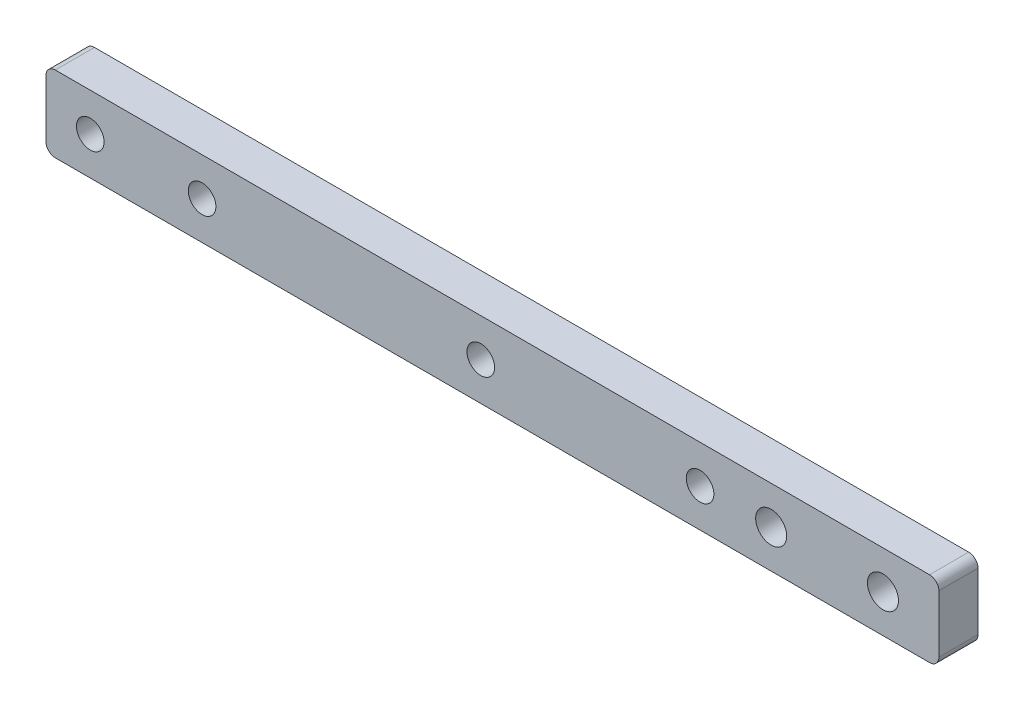
ISO-10303-21;
HEADER;
FILE_DESCRIPTION(('STEP AP214'),'2;1');
FILE_NAME('part.step','',(''),(''),'','','');
FILE_SCHEMA(('AUTOMOTIVE_DESIGN { 1 0 10303 214 1 1 1 1 }'));
ENDSEC;
DATA;
#1=APPLICATION_CONTEXT('core data for automotive mechanical design processes');
#2=APPLICATION_PROTOCOL_DEFINITION('international standard','automotive_design',2000,#1);
#3=PRODUCT_CONTEXT('',#1,'mechanical');
#4=PRODUCT('Part','Part','',(#3));
#5=PRODUCT_RELATED_PRODUCT_CATEGORY('part','',(#4));
#6=PRODUCT_DEFINITION_FORMATION('','',#4);
#7=PRODUCT_DEFINITION_CONTEXT('part definition',#1,'design');
#8=PRODUCT_DEFINITION('design','',#6,#7);
#9=PRODUCT_DEFINITION_SHAPE('','',#8);
#10=(LENGTH_UNIT() NAMED_UNIT(*) SI_UNIT(.MILLI.,.METRE.));
#11=(NAMED_UNIT(*) PLANE_ANGLE_UNIT() SI_UNIT($,.RADIAN.));
#12=(NAMED_UNIT(*) SI_UNIT($,.STERADIAN.) SOLID_ANGLE_UNIT());
#13=UNCERTAINTY_MEASURE_WITH_UNIT(LENGTH_MEASURE(1.E-05),#10,'distance_accuracy_value','');
#14=(GEOMETRIC_REPRESENTATION_CONTEXT(3) GLOBAL_UNCERTAINTY_ASSIGNED_CONTEXT((#13)) GLOBAL_UNIT_ASSIGNED_CONTEXT((#10,
#11,#12)) REPRESENTATION_CONTEXT('',''));
#15=CARTESIAN_POINT('',(0.,0.,0.));
#16=DIRECTION('',(0.,0.,1.));
#17=DIRECTION('',(1.,0.,0.));
#18=AXIS2_PLACEMENT_3D('',#15,#16,#17);
#19=CARTESIAN_POINT('',(0.,0.,3.2004));
#20=DIRECTION('',(0.,0.,1.));
#21=DIRECTION('',(1.,0.,0.));
#22=AXIS2_PLACEMENT_3D('',#19,#20,#21);
#23=PLANE('',#22);
#24=CARTESIAN_POINT('',(35.56,3.11150000000001,3.2004));
#25=DIRECTION('',(0.,0.,1.));
#26=DIRECTION('',(1.,0.,0.));
#27=AXIS2_PLACEMENT_3D('',#24,#25,#26);
#28=CIRCLE('',#27,1.1303);
#29=CARTESIAN_POINT('',(36.6903,3.11150000000001,3.2004));
#30=VERTEX_POINT('',#29);
#31=EDGE_CURVE('E204',#30,#30,#28,.T.);
#32=ORIENTED_EDGE('',*,*,#31,.F.);
#33=EDGE_LOOP('',(#32));
#34=FACE_BOUND('',#33,.T.);
#35=CARTESIAN_POINT('',(53.4924,3.11150000000002,3.2004));
#36=DIRECTION('',(0.,0.,1.));
#37=DIRECTION('',(1.,0.,0.));
#38=AXIS2_PLACEMENT_3D('',#35,#36,#37);
#39=CIRCLE('',#38,1.1303);
#40=CARTESIAN_POINT('',(54.6227,3.11150000000002,3.2004));
#41=VERTEX_POINT('',#40);
#42=EDGE_CURVE('E205',#41,#41,#39,.T.);
#43=ORIENTED_EDGE('',*,*,#42,.F.);
#44=EDGE_LOOP('',(#43));
#45=FACE_BOUND('',#44,.T.);
#46=CARTESIAN_POINT('',(3.6195,3.1115,3.2004));
#47=DIRECTION('',(0.,0.,1.));
#48=DIRECTION('',(1.,0.,0.));
#49=AXIS2_PLACEMENT_3D('',#46,#47,#48);
#50=CIRCLE('',#49,1.1303);
#51=CARTESIAN_POINT('',(4.7498,3.1115,3.2004));
#52=VERTEX_POINT('',#51);
#53=EDGE_CURVE('E186',#52,#52,#50,.T.);
#54=ORIENTED_EDGE('',*,*,#53,.F.);
#55=EDGE_LOOP('',(#54));
#56=FACE_BOUND('',#55,.T.);
#57=CARTESIAN_POINT('',(59.309,3.11150000000001,3.2004));
#58=DIRECTION('',(0.,0.,1.));
#59=DIRECTION('',(1.,0.,0.));
#60=AXIS2_PLACEMENT_3D('',#57,#58,#59);
#61=CIRCLE('',#60,1.27);
#62=CARTESIAN_POINT('',(60.579,3.11150000000001,3.2004));
#63=VERTEX_POINT('',#62);
#64=EDGE_CURVE('E132',#63,#63,#61,.T.);
#65=ORIENTED_EDGE('',*,*,#64,.F.);
#66=EDGE_LOOP('',(#65));
#67=FACE_BOUND('',#66,.T.);
#68=DIRECTION('',(0.,-1.,0.));
#69=VECTOR('',#68,1.);
#70=CARTESIAN_POINT('',(0.,6.223,3.2004));
#71=LINE('',#70,#69);
#72=CARTESIAN_POINT('',(0.,5.461,3.2004));
#73=VERTEX_POINT('',#72);
#74=CARTESIAN_POINT('',(0.,0.762,3.2004));
#75=VERTEX_POINT('',#74);
#76=EDGE_CURVE('E137',#73,#75,#71,.T.);
#77=ORIENTED_EDGE('',*,*,#76,.T.);
#78=CARTESIAN_POINT('',(0.762,0.762,3.2004));
#79=DIRECTION('',(0.,0.,1.));
#80=DIRECTION('',(1.,0.,0.));
#81=AXIS2_PLACEMENT_3D('',#78,#79,#80);
#82=CIRCLE('',#81,0.762);
#83=CARTESIAN_POINT('',(0.762,0.,3.2004));
#84=VERTEX_POINT('',#83);
#85=EDGE_CURVE('E152',#75,#84,#82,.T.);
#86=ORIENTED_EDGE('',*,*,#85,.T.);
#87=DIRECTION('',(1.,0.,0.));
#88=VECTOR('',#87,1.);
#89=CARTESIAN_POINT('',(0.,0.,3.2004));
#90=LINE('',#89,#88);
#91=CARTESIAN_POINT('',(72.263,0.,3.2004));
#92=VERTEX_POINT('',#91);
#93=EDGE_CURVE('E119',#84,#92,#90,.T.);
#94=ORIENTED_EDGE('',*,*,#93,.T.);
#95=CARTESIAN_POINT('',(72.263,0.762,3.2004));
#96=DIRECTION('',(0.,0.,1.));
#97=DIRECTION('',(1.,0.,0.));
#98=AXIS2_PLACEMENT_3D('',#95,#96,#97);
#99=CIRCLE('',#98,0.762);
#100=CARTESIAN_POINT('',(73.025,0.762,3.2004));
#101=VERTEX_POINT('',#100);
#102=EDGE_CURVE('E150',#92,#101,#99,.T.);
#103=ORIENTED_EDGE('',*,*,#102,.T.);
#104=DIRECTION('',(0.,1.,0.));
#105=VECTOR('',#104,1.);
#106=CARTESIAN_POINT('',(73.025,6.22300000000003,3.2004));
#107=LINE('',#106,#105);
#108=CARTESIAN_POINT('',(73.025,5.46100000000003,3.2004));
#109=VERTEX_POINT('',#108);
#110=EDGE_CURVE('E163',#101,#109,#107,.T.);
#111=ORIENTED_EDGE('',*,*,#110,.T.);
#112=CARTESIAN_POINT('',(72.263,5.46100000000003,3.2004));
#113=DIRECTION('',(0.,0.,1.));
#114=DIRECTION('',(1.,0.,0.));
#115=AXIS2_PLACEMENT_3D('',#112,#113,#114);
#116=CIRCLE('',#115,0.762);
#117=CARTESIAN_POINT('',(72.263,6.22300000000003,3.2004));
#118=VERTEX_POINT('',#117);
#119=EDGE_CURVE('E54',#109,#118,#116,.T.);
#120=ORIENTED_EDGE('',*,*,#119,.T.);
#121=DIRECTION('',(-1.,0.,0.));
#122=VECTOR('',#121,1.);
#123=CARTESIAN_POINT('',(0.,6.223,3.2004));
#124=LINE('',#123,#122);
#125=CARTESIAN_POINT('',(0.761999999999998,6.223,3.2004));
#126=VERTEX_POINT('',#125);
#127=EDGE_CURVE('E138',#118,#126,#124,.T.);
#128=ORIENTED_EDGE('',*,*,#127,.T.);
#129=CARTESIAN_POINT('',(0.761999999999999,5.461,3.2004));
#130=DIRECTION('',(0.,0.,1.));
#131=DIRECTION('',(1.,0.,0.));
#132=AXIS2_PLACEMENT_3D('',#129,#130,#131);
#133=CIRCLE('',#132,0.762);
#134=EDGE_CURVE('E147',#126,#73,#133,.T.);
#135=ORIENTED_EDGE('',*,*,#134,.T.);
#136=EDGE_LOOP('',(#77,#86,#94,#103,#111,#120,#128,#135));
#137=FACE_BOUND('',#136,.T.);
#138=CARTESIAN_POINT('',(68.453,3.11150000000002,3.2004));
#139=DIRECTION('',(0.,0.,1.));
#140=DIRECTION('',(1.,0.,0.));
#141=AXIS2_PLACEMENT_3D('',#138,#139,#140);
#142=CIRCLE('',#141,1.26999999999999);
#143=CARTESIAN_POINT('',(69.723,3.11150000000002,3.2004));
#144=VERTEX_POINT('',#143);
#145=EDGE_CURVE('E180',#144,#144,#142,.T.);
#146=ORIENTED_EDGE('',*,*,#145,.F.);
#147=EDGE_LOOP('',(#146));
#148=FACE_BOUND('',#147,.T.);
#149=CARTESIAN_POINT('',(12.7635,3.1115,3.2004));
#150=DIRECTION('',(0.,0.,1.));
#151=DIRECTION('',(1.,0.,0.));
#152=AXIS2_PLACEMENT_3D('',#149,#150,#151);
#153=CIRCLE('',#152,1.1303);
#154=CARTESIAN_POINT('',(13.8938,3.1115,3.2004));
#155=VERTEX_POINT('',#154);
#156=EDGE_CURVE('E192',#155,#155,#153,.T.);
#157=ORIENTED_EDGE('',*,*,#156,.F.);
#158=EDGE_LOOP('',(#157));
#159=FACE_BOUND('',#158,.T.);
#160=ADVANCED_FACE('F33',(#34,#45,#56,#67,#137,#148,#159),#23,.T.);
#161=CARTESIAN_POINT('',(0.,0.,0.));
#162=DIRECTION('',(0.,0.,1.));
#163=DIRECTION('',(1.,0.,0.));
#164=AXIS2_PLACEMENT_3D('',#161,#162,#163);
#165=PLANE('',#164);
#166=CARTESIAN_POINT('',(35.56,3.11150000000001,0.));
#167=DIRECTION('',(0.,0.,1.));
#168=DIRECTION('',(1.,0.,0.));
#169=AXIS2_PLACEMENT_3D('',#166,#167,#168);
#170=CIRCLE('',#169,1.1303);
#171=CARTESIAN_POINT('',(36.6903,3.11150000000001,0.));
#172=VERTEX_POINT('',#171);
#173=EDGE_CURVE('E198',#172,#172,#170,.F.);
#174=ORIENTED_EDGE('',*,*,#173,.F.);
#175=EDGE_LOOP('',(#174));
#176=FACE_BOUND('',#175,.T.);
#177=CARTESIAN_POINT('',(53.4924,3.11150000000002,0.));
#178=DIRECTION('',(0.,0.,1.));
#179=DIRECTION('',(1.,0.,0.));
#180=AXIS2_PLACEMENT_3D('',#177,#178,#179);
#181=CIRCLE('',#180,1.1303);
#182=CARTESIAN_POINT('',(54.6227,3.11150000000002,0.));
#183=VERTEX_POINT('',#182);
#184=EDGE_CURVE('E201',#183,#183,#181,.F.);
#185=ORIENTED_EDGE('',*,*,#184,.F.);
#186=EDGE_LOOP('',(#185));
#187=FACE_BOUND('',#186,.T.);
#188=DIRECTION('',(1.,0.,0.));
#189=VECTOR('',#188,1.);
#190=CARTESIAN_POINT('',(0.,0.,0.));
#191=LINE('',#190,#189);
#192=CARTESIAN_POINT('',(0.762,0.,0.));
#193=VERTEX_POINT('',#192);
#194=CARTESIAN_POINT('',(72.263,0.,0.));
#195=VERTEX_POINT('',#194);
#196=EDGE_CURVE('E116',#193,#195,#191,.T.);
#197=ORIENTED_EDGE('',*,*,#196,.F.);
#198=CARTESIAN_POINT('',(0.762,0.762,0.));
#199=DIRECTION('',(0.,0.,1.));
#200=DIRECTION('',(1.,0.,0.));
#201=AXIS2_PLACEMENT_3D('',#198,#199,#200);
#202=CIRCLE('',#201,0.762);
#203=CARTESIAN_POINT('',(0.,0.762,0.));
#204=VERTEX_POINT('',#203);
#205=EDGE_CURVE('E99',#193,#204,#202,.F.);
#206=ORIENTED_EDGE('',*,*,#205,.T.);
#207=DIRECTION('',(0.,-1.,0.));
#208=VECTOR('',#207,1.);
#209=CARTESIAN_POINT('',(0.,6.223,0.));
#210=LINE('',#209,#208);
#211=CARTESIAN_POINT('',(0.,5.461,0.));
#212=VERTEX_POINT('',#211);
#213=EDGE_CURVE('E127',#212,#204,#210,.T.);
#214=ORIENTED_EDGE('',*,*,#213,.F.);
#215=CARTESIAN_POINT('',(0.761999999999999,5.461,0.));
#216=DIRECTION('',(0.,0.,1.));
#217=DIRECTION('',(1.,0.,0.));
#218=AXIS2_PLACEMENT_3D('',#215,#216,#217);
#219=CIRCLE('',#218,0.762);
#220=CARTESIAN_POINT('',(0.761999999999998,6.223,0.));
#221=VERTEX_POINT('',#220);
#222=EDGE_CURVE('E120',#212,#221,#219,.F.);
#223=ORIENTED_EDGE('',*,*,#222,.T.);
#224=DIRECTION('',(-1.,0.,0.));
#225=VECTOR('',#224,1.);
#226=CARTESIAN_POINT('',(0.,6.223,0.));
#227=LINE('',#226,#225);
#228=CARTESIAN_POINT('',(72.263,6.22300000000003,0.));
#229=VERTEX_POINT('',#228);
#230=EDGE_CURVE('E130',#229,#221,#227,.T.);
#231=ORIENTED_EDGE('',*,*,#230,.F.);
#232=CARTESIAN_POINT('',(72.263,5.46100000000003,0.));
#233=DIRECTION('',(0.,0.,1.));
#234=DIRECTION('',(1.,0.,0.));
#235=AXIS2_PLACEMENT_3D('',#232,#233,#234);
#236=CIRCLE('',#235,0.762);
#237=CARTESIAN_POINT('',(73.025,5.46100000000003,0.));
#238=VERTEX_POINT('',#237);
#239=EDGE_CURVE('E141',#229,#238,#236,.F.);
#240=ORIENTED_EDGE('',*,*,#239,.T.);
#241=DIRECTION('',(0.,1.,0.));
#242=VECTOR('',#241,1.);
#243=CARTESIAN_POINT('',(73.025,6.22300000000003,0.));
#244=LINE('',#243,#242);
#245=CARTESIAN_POINT('',(73.025,0.762,0.));
#246=VERTEX_POINT('',#245);
#247=EDGE_CURVE('E126',#246,#238,#244,.T.);
#248=ORIENTED_EDGE('',*,*,#247,.F.);
#249=CARTESIAN_POINT('',(72.263,0.762,0.));
#250=DIRECTION('',(0.,0.,1.));
#251=DIRECTION('',(1.,0.,0.));
#252=AXIS2_PLACEMENT_3D('',#249,#250,#251);
#253=CIRCLE('',#252,0.762);
#254=EDGE_CURVE('E110',#246,#195,#253,.F.);
#255=ORIENTED_EDGE('',*,*,#254,.T.);
#256=EDGE_LOOP('',(#197,#206,#214,#223,#231,#240,#248,#255));
#257=FACE_BOUND('',#256,.T.);
#258=CARTESIAN_POINT('',(59.309,3.11150000000001,0.));
#259=DIRECTION('',(0.,0.,1.));
#260=DIRECTION('',(1.,0.,0.));
#261=AXIS2_PLACEMENT_3D('',#258,#259,#260);
#262=CIRCLE('',#261,1.27);
#263=CARTESIAN_POINT('',(60.579,3.11150000000001,0.));
#264=VERTEX_POINT('',#263);
#265=EDGE_CURVE('E177',#264,#264,#262,.T.);
#266=ORIENTED_EDGE('',*,*,#265,.T.);
#267=EDGE_LOOP('',(#266));
#268=FACE_BOUND('',#267,.T.);
#269=CARTESIAN_POINT('',(68.453,3.11150000000002,0.));
#270=DIRECTION('',(0.,0.,1.));
#271=DIRECTION('',(1.,0.,0.));
#272=AXIS2_PLACEMENT_3D('',#269,#270,#271);
#273=CIRCLE('',#272,1.26999999999999);
#274=CARTESIAN_POINT('',(69.723,3.11150000000002,0.));
#275=VERTEX_POINT('',#274);
#276=EDGE_CURVE('E183',#275,#275,#273,.T.);
#277=ORIENTED_EDGE('',*,*,#276,.T.);
#278=EDGE_LOOP('',(#277));
#279=FACE_BOUND('',#278,.T.);
#280=CARTESIAN_POINT('',(3.6195,3.1115,0.));
#281=DIRECTION('',(0.,0.,1.));
#282=DIRECTION('',(1.,0.,0.));
#283=AXIS2_PLACEMENT_3D('',#280,#281,#282);
#284=CIRCLE('',#283,1.1303);
#285=CARTESIAN_POINT('',(4.7498,3.1115,0.));
#286=VERTEX_POINT('',#285);
#287=EDGE_CURVE('E189',#286,#286,#284,.T.);
#288=ORIENTED_EDGE('',*,*,#287,.T.);
#289=EDGE_LOOP('',(#288));
#290=FACE_BOUND('',#289,.T.);
#291=CARTESIAN_POINT('',(12.7635,3.1115,0.));
#292=DIRECTION('',(0.,0.,1.));
#293=DIRECTION('',(1.,0.,0.));
#294=AXIS2_PLACEMENT_3D('',#291,#292,#293);
#295=CIRCLE('',#294,1.1303);
#296=CARTESIAN_POINT('',(13.8938,3.1115,0.));
#297=VERTEX_POINT('',#296);
#298=EDGE_CURVE('E195',#297,#297,#295,.T.);
#299=ORIENTED_EDGE('',*,*,#298,.T.);
#300=EDGE_LOOP('',(#299));
#301=FACE_BOUND('',#300,.T.);
#302=ADVANCED_FACE('F123',(#176,#187,#257,#268,#279,#290,#301),#165,.F.);
#303=CARTESIAN_POINT('',(0.,6.223,3.2004));
#304=DIRECTION('',(1.,0.,0.));
#305=DIRECTION('',(0.,1.,0.));
#306=AXIS2_PLACEMENT_3D('',#303,#304,#305);
#307=PLANE('',#306);
#308=ORIENTED_EDGE('',*,*,#213,.T.);
#309=DIRECTION('',(0.,0.,-1.));
#310=VECTOR('',#309,1.);
#311=CARTESIAN_POINT('',(0.,0.762,3.2004));
#312=LINE('',#311,#310);
#313=EDGE_CURVE('E104',#204,#75,#312,.F.);
#314=ORIENTED_EDGE('',*,*,#313,.T.);
#315=ORIENTED_EDGE('',*,*,#76,.F.);
#316=DIRECTION('',(0.,0.,-1.));
#317=VECTOR('',#316,1.);
#318=CARTESIAN_POINT('',(0.,5.461,3.2004));
#319=LINE('',#318,#317);
#320=EDGE_CURVE('E109',#73,#212,#319,.T.);
#321=ORIENTED_EDGE('',*,*,#320,.T.);
#322=EDGE_LOOP('',(#308,#314,#315,#321));
#323=FACE_BOUND('',#322,.T.);
#324=ADVANCED_FACE('F238',(#323),#307,.F.);
#325=CARTESIAN_POINT('',(0.,0.,3.2004));
#326=DIRECTION('',(0.,1.,0.));
#327=DIRECTION('',(0.,0.,1.));
#328=AXIS2_PLACEMENT_3D('',#325,#326,#327);
#329=PLANE('',#328);
#330=ORIENTED_EDGE('',*,*,#93,.F.);
#331=DIRECTION('',(0.,0.,-1.));
#332=VECTOR('',#331,1.);
#333=CARTESIAN_POINT('',(0.762,0.,3.2004));
#334=LINE('',#333,#332);
#335=EDGE_CURVE('E103',#84,#193,#334,.T.);
#336=ORIENTED_EDGE('',*,*,#335,.T.);
#337=ORIENTED_EDGE('',*,*,#196,.T.);
#338=DIRECTION('',(0.,0.,-1.));
#339=VECTOR('',#338,1.);
#340=CARTESIAN_POINT('',(72.263,0.,3.2004));
#341=LINE('',#340,#339);
#342=EDGE_CURVE('E121',#195,#92,#341,.F.);
#343=ORIENTED_EDGE('',*,*,#342,.T.);
#344=EDGE_LOOP('',(#330,#336,#337,#343));
#345=FACE_BOUND('',#344,.T.);
#346=ADVANCED_FACE('F115',(#345),#329,.F.);
#347=CARTESIAN_POINT('',(73.025,6.22300000000003,3.2004));
#348=DIRECTION('',(-1.,0.,0.));
#349=DIRECTION('',(0.,0.,1.));
#350=AXIS2_PLACEMENT_3D('',#347,#348,#349);
#351=PLANE('',#350);
#352=ORIENTED_EDGE('',*,*,#110,.F.);
#353=DIRECTION('',(0.,0.,-1.));
#354=VECTOR('',#353,1.);
#355=CARTESIAN_POINT('',(73.025,0.762,3.2004));
#356=LINE('',#355,#354);
#357=EDGE_CURVE('E156',#101,#246,#356,.T.);
#358=ORIENTED_EDGE('',*,*,#357,.T.);
#359=ORIENTED_EDGE('',*,*,#247,.T.);
#360=DIRECTION('',(0.,0.,-1.));
#361=VECTOR('',#360,1.);
#362=CARTESIAN_POINT('',(73.025,5.46100000000003,3.2004));
#363=LINE('',#362,#361);
#364=EDGE_CURVE('E154',#238,#109,#363,.F.);
#365=ORIENTED_EDGE('',*,*,#364,.T.);
#366=EDGE_LOOP('',(#352,#358,#359,#365));
#367=FACE_BOUND('',#366,.T.);
#368=ADVANCED_FACE('F161',(#367),#351,.F.);
#369=CARTESIAN_POINT('',(0.,6.223,3.2004));
#370=DIRECTION('',(0.,-1.,0.));
#371=DIRECTION('',(1.,0.,0.));
#372=AXIS2_PLACEMENT_3D('',#369,#370,#371);
#373=PLANE('',#372);
#374=ORIENTED_EDGE('',*,*,#127,.F.);
#375=DIRECTION('',(0.,0.,-1.));
#376=VECTOR('',#375,1.);
#377=CARTESIAN_POINT('',(72.263,6.22300000000003,3.2004));
#378=LINE('',#377,#376);
#379=EDGE_CURVE('E11',#118,#229,#378,.T.);
#380=ORIENTED_EDGE('',*,*,#379,.T.);
#381=ORIENTED_EDGE('',*,*,#230,.T.);
#382=DIRECTION('',(0.,0.,-1.));
#383=VECTOR('',#382,1.);
#384=CARTESIAN_POINT('',(0.761999999999998,6.223,3.2004));
#385=LINE('',#384,#383);
#386=EDGE_CURVE('E41',#221,#126,#385,.F.);
#387=ORIENTED_EDGE('',*,*,#386,.T.);
#388=EDGE_LOOP('',(#374,#380,#381,#387));
#389=FACE_BOUND('',#388,.T.);
#390=ADVANCED_FACE('F170',(#389),#373,.F.);
#391=CARTESIAN_POINT('',(59.309,3.11150000000001,3.2004));
#392=DIRECTION('',(0.,0.,-1.));
#393=DIRECTION('',(-1.,0.,0.));
#394=AXIS2_PLACEMENT_3D('',#391,#392,#393);
#395=CYLINDRICAL_SURFACE('',#394,1.27);
#396=ORIENTED_EDGE('',*,*,#64,.T.);
#397=EDGE_LOOP('',(#396));
#398=FACE_BOUND('',#397,.T.);
#399=ORIENTED_EDGE('',*,*,#265,.F.);
#400=EDGE_LOOP('',(#399));
#401=FACE_BOUND('',#400,.T.);
#402=ADVANCED_FACE('F252',(#398,#401),#395,.F.);
#403=CARTESIAN_POINT('',(68.453,3.11150000000002,3.2004));
#404=DIRECTION('',(0.,0.,-1.));
#405=DIRECTION('',(-1.,0.,0.));
#406=AXIS2_PLACEMENT_3D('',#403,#404,#405);
#407=CYLINDRICAL_SURFACE('',#406,1.26999999999999);
#408=ORIENTED_EDGE('',*,*,#145,.T.);
#409=EDGE_LOOP('',(#408));
#410=FACE_BOUND('',#409,.T.);
#411=ORIENTED_EDGE('',*,*,#276,.F.);
#412=EDGE_LOOP('',(#411));
#413=FACE_BOUND('',#412,.T.);
#414=ADVANCED_FACE('F354',(#410,#413),#407,.F.);
#415=CARTESIAN_POINT('',(3.6195,3.1115,3.2004));
#416=DIRECTION('',(0.,0.,-1.));
#417=DIRECTION('',(-1.,0.,0.));
#418=AXIS2_PLACEMENT_3D('',#415,#416,#417);
#419=CYLINDRICAL_SURFACE('',#418,1.1303);
#420=ORIENTED_EDGE('',*,*,#53,.T.);
#421=EDGE_LOOP('',(#420));
#422=FACE_BOUND('',#421,.T.);
#423=ORIENTED_EDGE('',*,*,#287,.F.);
#424=EDGE_LOOP('',(#423));
#425=FACE_BOUND('',#424,.T.);
#426=ADVANCED_FACE('F233',(#422,#425),#419,.F.);
#427=CARTESIAN_POINT('',(12.7635,3.1115,3.2004));
#428=DIRECTION('',(0.,0.,-1.));
#429=DIRECTION('',(-1.,0.,0.));
#430=AXIS2_PLACEMENT_3D('',#427,#428,#429);
#431=CYLINDRICAL_SURFACE('',#430,1.1303);
#432=ORIENTED_EDGE('',*,*,#156,.T.);
#433=EDGE_LOOP('',(#432));
#434=FACE_BOUND('',#433,.T.);
#435=ORIENTED_EDGE('',*,*,#298,.F.);
#436=EDGE_LOOP('',(#435));
#437=FACE_BOUND('',#436,.T.);
#438=ADVANCED_FACE('F229',(#434,#437),#431,.F.);
#439=CARTESIAN_POINT('',(53.4924,3.11150000000002,-3.19697117910062));
#440=DIRECTION('',(0.,0.,1.));
#441=DIRECTION('',(1.,0.,0.));
#442=AXIS2_PLACEMENT_3D('',#439,#440,#441);
#443=CYLINDRICAL_SURFACE('',#442,1.1303);
#444=ORIENTED_EDGE('',*,*,#184,.T.);
#445=EDGE_LOOP('',(#444));
#446=FACE_BOUND('',#445,.T.);
#447=ORIENTED_EDGE('',*,*,#42,.T.);
#448=EDGE_LOOP('',(#447));
#449=FACE_BOUND('',#448,.T.);
#450=ADVANCED_FACE('F232',(#446,#449),#443,.F.);
#451=CARTESIAN_POINT('',(35.56,3.11150000000001,-3.19697117910062));
#452=DIRECTION('',(0.,0.,1.));
#453=DIRECTION('',(1.,0.,0.));
#454=AXIS2_PLACEMENT_3D('',#451,#452,#453);
#455=CYLINDRICAL_SURFACE('',#454,1.1303);
#456=ORIENTED_EDGE('',*,*,#173,.T.);
#457=EDGE_LOOP('',(#456));
#458=FACE_BOUND('',#457,.T.);
#459=ORIENTED_EDGE('',*,*,#31,.T.);
#460=EDGE_LOOP('',(#459));
#461=FACE_BOUND('',#460,.T.);
#462=ADVANCED_FACE('F213',(#458,#461),#455,.F.);
#463=CARTESIAN_POINT('',(0.762,0.762,3.2004));
#464=DIRECTION('',(0.,0.,-1.));
#465=DIRECTION('',(-1.,0.,0.));
#466=AXIS2_PLACEMENT_3D('',#463,#464,#465);
#467=CYLINDRICAL_SURFACE('',#466,0.762);
#468=ORIENTED_EDGE('',*,*,#85,.F.);
#469=ORIENTED_EDGE('',*,*,#313,.F.);
#470=ORIENTED_EDGE('',*,*,#205,.F.);
#471=ORIENTED_EDGE('',*,*,#335,.F.);
#472=EDGE_LOOP('',(#468,#469,#470,#471));
#473=FACE_BOUND('',#472,.T.);
#474=ADVANCED_FACE('F102',(#473),#467,.T.);
#475=CARTESIAN_POINT('',(72.263,0.762,3.2004));
#476=DIRECTION('',(0.,0.,-1.));
#477=DIRECTION('',(-1.,0.,0.));
#478=AXIS2_PLACEMENT_3D('',#475,#476,#477);
#479=CYLINDRICAL_SURFACE('',#478,0.762);
#480=ORIENTED_EDGE('',*,*,#102,.F.);
#481=ORIENTED_EDGE('',*,*,#342,.F.);
#482=ORIENTED_EDGE('',*,*,#254,.F.);
#483=ORIENTED_EDGE('',*,*,#357,.F.);
#484=EDGE_LOOP('',(#480,#481,#482,#483));
#485=FACE_BOUND('',#484,.T.);
#486=ADVANCED_FACE('F259',(#485),#479,.T.);
#487=CARTESIAN_POINT('',(72.263,5.46100000000003,3.2004));
#488=DIRECTION('',(0.,0.,-1.));
#489=DIRECTION('',(-1.,0.,0.));
#490=AXIS2_PLACEMENT_3D('',#487,#488,#489);
#491=CYLINDRICAL_SURFACE('',#490,0.762);
#492=ORIENTED_EDGE('',*,*,#119,.F.);
#493=ORIENTED_EDGE('',*,*,#364,.F.);
#494=ORIENTED_EDGE('',*,*,#239,.F.);
#495=ORIENTED_EDGE('',*,*,#379,.F.);
#496=EDGE_LOOP('',(#492,#493,#494,#495));
#497=FACE_BOUND('',#496,.T.);
#498=ADVANCED_FACE('F169',(#497),#491,.T.);
#499=CARTESIAN_POINT('',(0.761999999999999,5.461,3.2004));
#500=DIRECTION('',(0.,0.,-1.));
#501=DIRECTION('',(-1.,0.,0.));
#502=AXIS2_PLACEMENT_3D('',#499,#500,#501);
#503=CYLINDRICAL_SURFACE('',#502,0.762);
#504=ORIENTED_EDGE('',*,*,#134,.F.);
#505=ORIENTED_EDGE('',*,*,#386,.F.);
#506=ORIENTED_EDGE('',*,*,#222,.F.);
#507=ORIENTED_EDGE('',*,*,#320,.F.);
#508=EDGE_LOOP('',(#504,#505,#506,#507));
#509=FACE_BOUND('',#508,.T.);
#510=ADVANCED_FACE('F35',(#509),#503,.T.);
#511=CLOSED_SHELL('',(#160,#302,#324,#346,#368,#390,#402,#414,#426,#438,#450,#462,#474,#486,
#498,#510));
#512=MANIFOLD_SOLID_BREP('B2',#511);
#513=ADVANCED_BREP_SHAPE_REPRESENTATION('',(#18,#512),#14);
#514=SHAPE_DEFINITION_REPRESENTATION(#9,#513);
ENDSEC;
END-ISO-10303-21;
